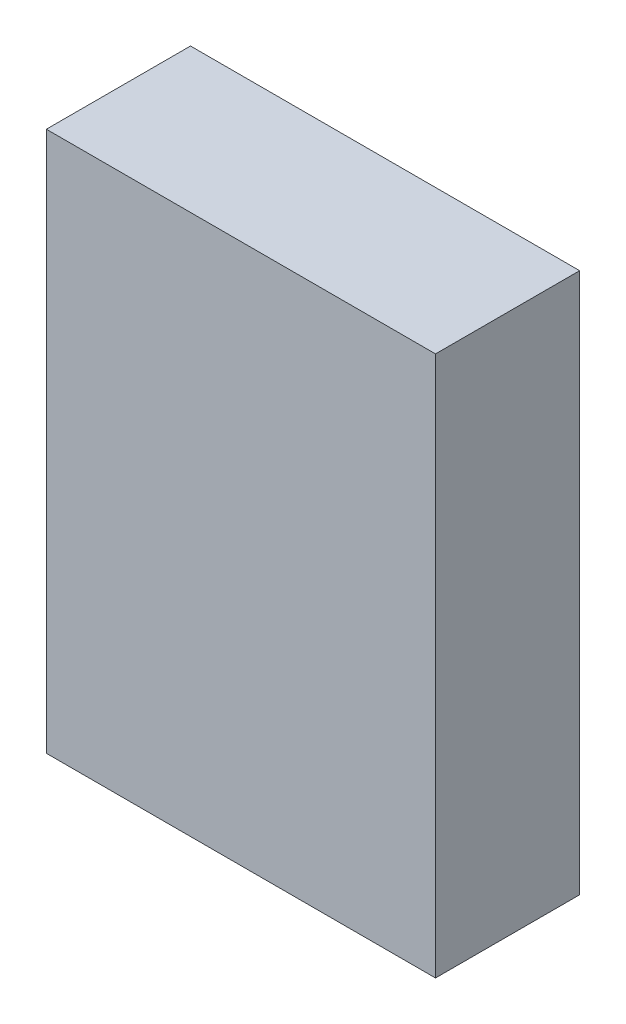
ISO-10303-21;
HEADER;
FILE_DESCRIPTION(('STEP AP214'),'2;1');
FILE_NAME('part.step','',(''),(''),'','','');
FILE_SCHEMA(('AUTOMOTIVE_DESIGN { 1 0 10303 214 1 1 1 1 }'));
ENDSEC;
DATA;
#1=APPLICATION_CONTEXT('core data for automotive mechanical design processes');
#2=APPLICATION_PROTOCOL_DEFINITION('international standard','automotive_design',2000,#1);
#3=PRODUCT_CONTEXT('',#1,'mechanical');
#4=PRODUCT('Part','Part','',(#3));
#5=PRODUCT_RELATED_PRODUCT_CATEGORY('part','',(#4));
#6=PRODUCT_DEFINITION_FORMATION('','',#4);
#7=PRODUCT_DEFINITION_CONTEXT('part definition',#1,'design');
#8=PRODUCT_DEFINITION('design','',#6,#7);
#9=PRODUCT_DEFINITION_SHAPE('','',#8);
#10=(LENGTH_UNIT() NAMED_UNIT(*) SI_UNIT(.MILLI.,.METRE.));
#11=(NAMED_UNIT(*) PLANE_ANGLE_UNIT() SI_UNIT($,.RADIAN.));
#12=(NAMED_UNIT(*) SI_UNIT($,.STERADIAN.) SOLID_ANGLE_UNIT());
#13=UNCERTAINTY_MEASURE_WITH_UNIT(LENGTH_MEASURE(1.E-05),#10,'distance_accuracy_value','');
#14=(GEOMETRIC_REPRESENTATION_CONTEXT(3) GLOBAL_UNCERTAINTY_ASSIGNED_CONTEXT((#13)) GLOBAL_UNIT_ASSIGNED_CONTEXT((#10,
#11,#12)) REPRESENTATION_CONTEXT('',''));
#15=CARTESIAN_POINT('',(0.,0.,0.));
#16=DIRECTION('',(0.,0.,1.));
#17=DIRECTION('',(1.,0.,0.));
#18=AXIS2_PLACEMENT_3D('',#15,#16,#17);
#19=CARTESIAN_POINT('',(0.,0.,4.));
#20=DIRECTION('',(1.,0.,0.));
#21=DIRECTION('',(0.,1.,0.));
#22=AXIS2_PLACEMENT_3D('',#19,#20,#21);
#23=PLANE('',#22);
#24=DIRECTION('',(0.,-1.,0.));
#25=VECTOR('',#24,1.);
#26=CARTESIAN_POINT('',(0.,0.,0.));
#27=LINE('',#26,#25);
#28=CARTESIAN_POINT('',(0.,15.,0.));
#29=VERTEX_POINT('',#28);
#30=CARTESIAN_POINT('',(0.,0.,0.));
#31=VERTEX_POINT('',#30);
#32=EDGE_CURVE('E96',#29,#31,#27,.T.);
#33=ORIENTED_EDGE('',*,*,#32,.T.);
#34=DIRECTION('',(0.,0.,-1.));
#35=VECTOR('',#34,1.);
#36=CARTESIAN_POINT('',(0.,0.,4.));
#37=LINE('',#36,#35);
#38=CARTESIAN_POINT('',(0.,0.,4.));
#39=VERTEX_POINT('',#38);
#40=EDGE_CURVE('E11',#39,#31,#37,.T.);
#41=ORIENTED_EDGE('',*,*,#40,.F.);
#42=DIRECTION('',(0.,-1.,0.));
#43=VECTOR('',#42,1.);
#44=CARTESIAN_POINT('',(0.,0.,4.));
#45=LINE('',#44,#43);
#46=CARTESIAN_POINT('',(0.,15.,4.));
#47=VERTEX_POINT('',#46);
#48=EDGE_CURVE('E84',#47,#39,#45,.T.);
#49=ORIENTED_EDGE('',*,*,#48,.F.);
#50=DIRECTION('',(0.,0.,-1.));
#51=VECTOR('',#50,1.);
#52=CARTESIAN_POINT('',(0.,15.,4.));
#53=LINE('',#52,#51);
#54=EDGE_CURVE('E92',#47,#29,#53,.T.);
#55=ORIENTED_EDGE('',*,*,#54,.T.);
#56=EDGE_LOOP('',(#33,#41,#49,#55));
#57=FACE_BOUND('',#56,.T.);
#58=ADVANCED_FACE('F33',(#57),#23,.F.);
#59=CARTESIAN_POINT('',(0.,0.,4.));
#60=DIRECTION('',(0.,1.,0.));
#61=DIRECTION('',(0.,0.,1.));
#62=AXIS2_PLACEMENT_3D('',#59,#60,#61);
#63=PLANE('',#62);
#64=DIRECTION('',(1.,0.,0.));
#65=VECTOR('',#64,1.);
#66=CARTESIAN_POINT('',(0.,0.,0.));
#67=LINE('',#66,#65);
#68=CARTESIAN_POINT('',(10.8,0.,0.));
#69=VERTEX_POINT('',#68);
#70=EDGE_CURVE('E88',#31,#69,#67,.T.);
#71=ORIENTED_EDGE('',*,*,#70,.T.);
#72=DIRECTION('',(0.,0.,-1.));
#73=VECTOR('',#72,1.);
#74=CARTESIAN_POINT('',(10.8,0.,4.));
#75=LINE('',#74,#73);
#76=CARTESIAN_POINT('',(10.8,0.,4.));
#77=VERTEX_POINT('',#76);
#78=EDGE_CURVE('E41',#77,#69,#75,.T.);
#79=ORIENTED_EDGE('',*,*,#78,.F.);
#80=DIRECTION('',(1.,0.,0.));
#81=VECTOR('',#80,1.);
#82=CARTESIAN_POINT('',(0.,0.,4.));
#83=LINE('',#82,#81);
#84=EDGE_CURVE('E79',#39,#77,#83,.T.);
#85=ORIENTED_EDGE('',*,*,#84,.F.);
#86=ORIENTED_EDGE('',*,*,#40,.T.);
#87=EDGE_LOOP('',(#71,#79,#85,#86));
#88=FACE_BOUND('',#87,.T.);
#89=ADVANCED_FACE('F87',(#88),#63,.F.);
#90=CARTESIAN_POINT('',(10.8,0.,4.));
#91=DIRECTION('',(-1.,0.,0.));
#92=DIRECTION('',(0.,-1.,0.));
#93=AXIS2_PLACEMENT_3D('',#90,#91,#92);
#94=PLANE('',#93);
#95=DIRECTION('',(0.,1.,0.));
#96=VECTOR('',#95,1.);
#97=CARTESIAN_POINT('',(10.8,0.,0.));
#98=LINE('',#97,#96);
#99=CARTESIAN_POINT('',(10.8,15.,0.));
#100=VERTEX_POINT('',#99);
#101=EDGE_CURVE('E66',#69,#100,#98,.T.);
#102=ORIENTED_EDGE('',*,*,#101,.T.);
#103=DIRECTION('',(0.,0.,-1.));
#104=VECTOR('',#103,1.);
#105=CARTESIAN_POINT('',(10.8,15.,4.));
#106=LINE('',#105,#104);
#107=CARTESIAN_POINT('',(10.8,15.,4.));
#108=VERTEX_POINT('',#107);
#109=EDGE_CURVE('E89',#108,#100,#106,.T.);
#110=ORIENTED_EDGE('',*,*,#109,.F.);
#111=DIRECTION('',(0.,1.,0.));
#112=VECTOR('',#111,1.);
#113=CARTESIAN_POINT('',(10.8,0.,4.));
#114=LINE('',#113,#112);
#115=EDGE_CURVE('E82',#77,#108,#114,.T.);
#116=ORIENTED_EDGE('',*,*,#115,.F.);
#117=ORIENTED_EDGE('',*,*,#78,.T.);
#118=EDGE_LOOP('',(#102,#110,#116,#117));
#119=FACE_BOUND('',#118,.T.);
#120=ADVANCED_FACE('F90',(#119),#94,.F.);
#121=CARTESIAN_POINT('',(0.,15.,4.));
#122=DIRECTION('',(0.,-1.,0.));
#123=DIRECTION('',(0.,0.,-1.));
#124=AXIS2_PLACEMENT_3D('',#121,#122,#123);
#125=PLANE('',#124);
#126=DIRECTION('',(-1.,0.,0.));
#127=VECTOR('',#126,1.);
#128=CARTESIAN_POINT('',(0.,15.,0.));
#129=LINE('',#128,#127);
#130=EDGE_CURVE('E72',#100,#29,#129,.T.);
#131=ORIENTED_EDGE('',*,*,#130,.T.);
#132=ORIENTED_EDGE('',*,*,#54,.F.);
#133=DIRECTION('',(-1.,0.,0.));
#134=VECTOR('',#133,1.);
#135=CARTESIAN_POINT('',(0.,15.,4.));
#136=LINE('',#135,#134);
#137=EDGE_CURVE('E49',#108,#47,#136,.T.);
#138=ORIENTED_EDGE('',*,*,#137,.F.);
#139=ORIENTED_EDGE('',*,*,#109,.T.);
#140=EDGE_LOOP('',(#131,#132,#138,#139));
#141=FACE_BOUND('',#140,.T.);
#142=ADVANCED_FACE('F103',(#141),#125,.F.);
#143=CARTESIAN_POINT('',(0.,0.,4.));
#144=DIRECTION('',(0.,0.,-1.));
#145=DIRECTION('',(-1.,0.,0.));
#146=AXIS2_PLACEMENT_3D('',#143,#144,#145);
#147=PLANE('',#146);
#148=ORIENTED_EDGE('',*,*,#48,.T.);
#149=ORIENTED_EDGE('',*,*,#84,.T.);
#150=ORIENTED_EDGE('',*,*,#115,.T.);
#151=ORIENTED_EDGE('',*,*,#137,.T.);
#152=EDGE_LOOP('',(#148,#149,#150,#151));
#153=FACE_BOUND('',#152,.T.);
#154=ADVANCED_FACE('F80',(#153),#147,.F.);
#155=CARTESIAN_POINT('',(0.,0.,0.));
#156=DIRECTION('',(0.,0.,-1.));
#157=DIRECTION('',(-1.,0.,0.));
#158=AXIS2_PLACEMENT_3D('',#155,#156,#157);
#159=PLANE('',#158);
#160=ORIENTED_EDGE('',*,*,#32,.F.);
#161=ORIENTED_EDGE('',*,*,#130,.F.);
#162=ORIENTED_EDGE('',*,*,#101,.F.);
#163=ORIENTED_EDGE('',*,*,#70,.F.);
#164=EDGE_LOOP('',(#160,#161,#162,#163));
#165=FACE_BOUND('',#164,.T.);
#166=ADVANCED_FACE('F106',(#165),#159,.T.);
#167=CLOSED_SHELL('',(#58,#89,#120,#142,#154,#166));
#168=MANIFOLD_SOLID_BREP('B2',#167);
#169=ADVANCED_BREP_SHAPE_REPRESENTATION('',(#18,#168),#14);
#170=SHAPE_DEFINITION_REPRESENTATION(#9,#169);
ENDSEC;
END-ISO-10303-21;
